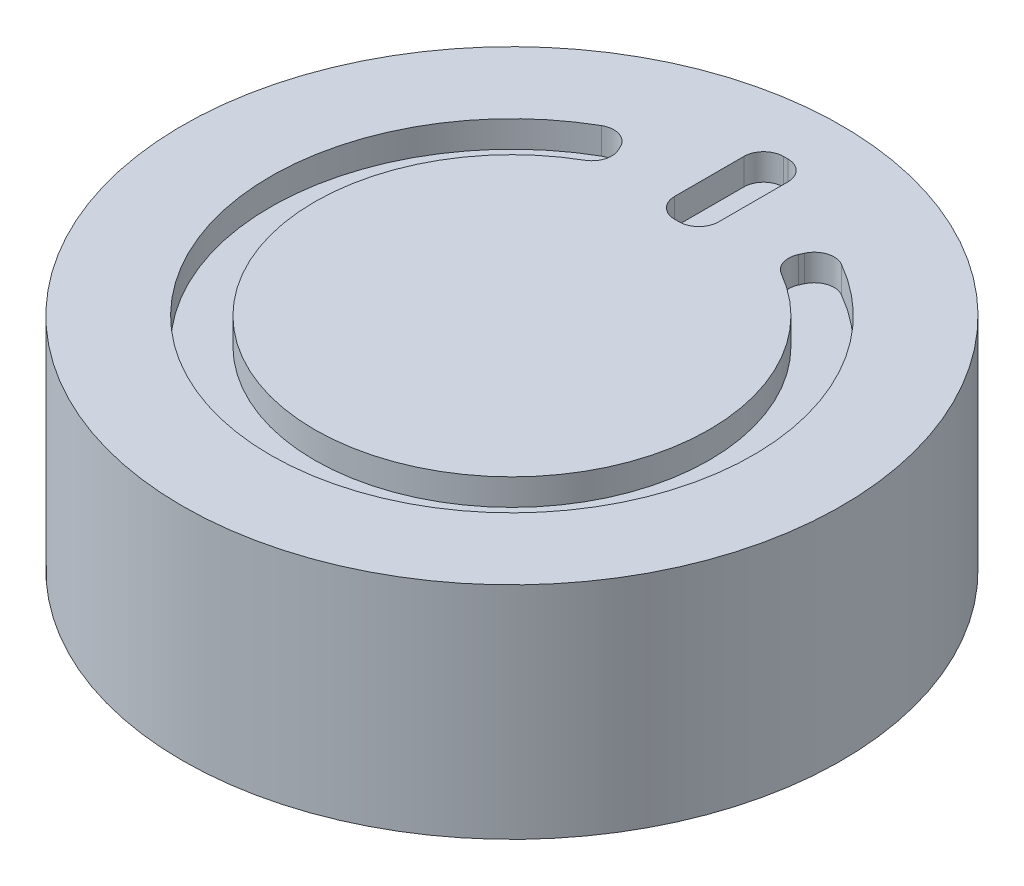
ISO-10303-21;
HEADER;
FILE_DESCRIPTION(('STEP AP214'),'2;1');
FILE_NAME('part.step','',(''),(''),'','','');
FILE_SCHEMA(('AUTOMOTIVE_DESIGN { 1 0 10303 214 1 1 1 1 }'));
ENDSEC;
DATA;
#1=APPLICATION_CONTEXT('core data for automotive mechanical design processes');
#2=APPLICATION_PROTOCOL_DEFINITION('international standard','automotive_design',2000,#1);
#3=PRODUCT_CONTEXT('',#1,'mechanical');
#4=PRODUCT('Part','Part','',(#3));
#5=PRODUCT_RELATED_PRODUCT_CATEGORY('part','',(#4));
#6=PRODUCT_DEFINITION_FORMATION('','',#4);
#7=PRODUCT_DEFINITION_CONTEXT('part definition',#1,'design');
#8=PRODUCT_DEFINITION('design','',#6,#7);
#9=PRODUCT_DEFINITION_SHAPE('','',#8);
#10=(LENGTH_UNIT() NAMED_UNIT(*) SI_UNIT(.MILLI.,.METRE.));
#11=(NAMED_UNIT(*) PLANE_ANGLE_UNIT() SI_UNIT($,.RADIAN.));
#12=(NAMED_UNIT(*) SI_UNIT($,.STERADIAN.) SOLID_ANGLE_UNIT());
#13=UNCERTAINTY_MEASURE_WITH_UNIT(LENGTH_MEASURE(1.E-05),#10,'distance_accuracy_value','');
#14=(GEOMETRIC_REPRESENTATION_CONTEXT(3) GLOBAL_UNCERTAINTY_ASSIGNED_CONTEXT((#13)) GLOBAL_UNIT_ASSIGNED_CONTEXT((#10,
#11,#12)) REPRESENTATION_CONTEXT('',''));
#15=CARTESIAN_POINT('',(0.,0.,0.));
#16=DIRECTION('',(0.,0.,1.));
#17=DIRECTION('',(1.,0.,0.));
#18=AXIS2_PLACEMENT_3D('',#15,#16,#17);
#19=CARTESIAN_POINT('',(0.,10.,0.));
#20=DIRECTION('',(0.,1.,0.));
#21=DIRECTION('',(0.,0.,1.));
#22=AXIS2_PLACEMENT_3D('',#19,#20,#21);
#23=PLANE('',#22);
#24=CARTESIAN_POINT('',(-4.9130049859856,10.,-8.5372643163768));
#25=DIRECTION('',(0.,1.,0.));
#26=DIRECTION('',(0.,0.,1.));
#27=AXIS2_PLACEMENT_3D('',#24,#25,#26);
#28=CIRCLE('',#27,0.9);
#29=CARTESIAN_POINT('',(-4.46410097711382,10.,-7.75720970878907));
#30=VERTEX_POINT('',#29);
#31=CARTESIAN_POINT('',(-4.09519676680745,10.,-8.91301651749446));
#32=VERTEX_POINT('',#31);
#33=EDGE_CURVE('E103',#30,#32,#28,.T.);
#34=ORIENTED_EDGE('',*,*,#33,.F.);
#35=CARTESIAN_POINT('',(0.,10.,0.));
#36=DIRECTION('',(0.,1.,0.));
#37=DIRECTION('',(0.,0.,1.));
#38=AXIS2_PLACEMENT_3D('',#35,#36,#37);
#39=CIRCLE('',#38,8.95);
#40=CARTESIAN_POINT('',(4.46410097711382,10.,-7.75720970878908));
#41=VERTEX_POINT('',#40);
#42=EDGE_CURVE('E210',#30,#41,#39,.T.);
#43=ORIENTED_EDGE('',*,*,#42,.T.);
#44=CARTESIAN_POINT('',(4.9130049859856,10.,-8.5372643163768));
#45=DIRECTION('',(0.,-1.,0.));
#46=DIRECTION('',(0.,0.,-1.));
#47=AXIS2_PLACEMENT_3D('',#44,#45,#46);
#48=CIRCLE('',#47,0.9);
#49=CARTESIAN_POINT('',(4.09519676680752,10.,-8.91301651749447));
#50=VERTEX_POINT('',#49);
#51=EDGE_CURVE('E217',#41,#50,#48,.T.);
#52=ORIENTED_EDGE('',*,*,#51,.T.);
#53=DIRECTION('',(0.417502445686298,0.,-0.908675799086759));
#54=VECTOR('',#53,1.);
#55=CARTESIAN_POINT('',(4.09519676680752,10.,-8.91301651749447));
#56=LINE('',#55,#54);
#57=CARTESIAN_POINT('',(4.17904098587748,10.,-9.0954997904654));
#58=VERTEX_POINT('',#57);
#59=EDGE_CURVE('E552',#50,#58,#56,.T.);
#60=ORIENTED_EDGE('',*,*,#59,.T.);
#61=CARTESIAN_POINT('',(4.99684920505556,10.,-8.71974758934773));
#62=DIRECTION('',(0.,1.,0.));
#63=DIRECTION('',(0.,0.,1.));
#64=AXIS2_PLACEMENT_3D('',#61,#62,#63);
#65=CIRCLE('',#64,0.899999999999999);
#66=CARTESIAN_POINT('',(5.44432823834412,10.,-9.50062050779678));
#67=VERTEX_POINT('',#66);
#68=EDGE_CURVE('E556',#67,#58,#65,.T.);
#69=ORIENTED_EDGE('',*,*,#68,.F.);
#70=CARTESIAN_POINT('',(0.,10.,0.));
#71=DIRECTION('',(0.,1.,0.));
#72=DIRECTION('',(0.,0.,1.));
#73=AXIS2_PLACEMENT_3D('',#70,#71,#72);
#74=CIRCLE('',#73,10.95);
#75=CARTESIAN_POINT('',(-5.44432823834412,10.,-9.50062050779678));
#76=VERTEX_POINT('',#75);
#77=EDGE_CURVE('E560',#76,#67,#74,.T.);
#78=ORIENTED_EDGE('',*,*,#77,.F.);
#79=CARTESIAN_POINT('',(-4.99684920505556,10.,-8.71974758934773));
#80=DIRECTION('',(0.,-1.,0.));
#81=DIRECTION('',(0.,0.,-1.));
#82=AXIS2_PLACEMENT_3D('',#79,#80,#81);
#83=CIRCLE('',#82,0.899999999999999);
#84=CARTESIAN_POINT('',(-4.17904098587748,10.,-9.09549979046539));
#85=VERTEX_POINT('',#84);
#86=EDGE_CURVE('E230',#76,#85,#83,.T.);
#87=ORIENTED_EDGE('',*,*,#86,.T.);
#88=DIRECTION('',(-0.417502445686294,0.,-0.908675799086761));
#89=VECTOR('',#88,1.);
#90=CARTESIAN_POINT('',(-4.09519676680751,10.,-8.91301651749446));
#91=LINE('',#90,#89);
#92=EDGE_CURVE('E223',#32,#85,#91,.T.);
#93=ORIENTED_EDGE('',*,*,#92,.F.);
#94=EDGE_LOOP('',(#34,#43,#52,#60,#69,#78,#87,#93));
#95=FACE_BOUND('',#94,.T.);
#96=CARTESIAN_POINT('',(0.,10.,0.));
#97=DIRECTION('',(0.,1.,0.));
#98=DIRECTION('',(0.,0.,1.));
#99=AXIS2_PLACEMENT_3D('',#96,#97,#98);
#100=CIRCLE('',#99,14.95);
#101=CARTESIAN_POINT('',(0.,10.,14.95));
#102=VERTEX_POINT('',#101);
#103=EDGE_CURVE('E12',#102,#102,#100,.T.);
#104=ORIENTED_EDGE('',*,*,#103,.T.);
#105=EDGE_LOOP('',(#104));
#106=FACE_BOUND('',#105,.T.);
#107=DIRECTION('',(1.,0.,0.));
#108=VECTOR('',#107,1.);
#109=CARTESIAN_POINT('',(0.,10.,-7.47958609432388));
#110=LINE('',#109,#108);
#111=CARTESIAN_POINT('',(-0.1,10.,-7.47958609432388));
#112=VERTEX_POINT('',#111);
#113=CARTESIAN_POINT('',(0.100000000000001,10.,-7.47958609432388));
#114=VERTEX_POINT('',#113);
#115=EDGE_CURVE('E228',#112,#114,#110,.T.);
#116=ORIENTED_EDGE('',*,*,#115,.F.);
#117=CARTESIAN_POINT('',(-0.1,10.,-8.37958609432388));
#118=DIRECTION('',(0.,1.,0.));
#119=DIRECTION('',(0.,0.,1.));
#120=AXIS2_PLACEMENT_3D('',#117,#118,#119);
#121=CIRCLE('',#120,0.9);
#122=CARTESIAN_POINT('',(-1.,10.,-8.37958609432388));
#123=VERTEX_POINT('',#122);
#124=EDGE_CURVE('E111',#112,#123,#121,.F.);
#125=ORIENTED_EDGE('',*,*,#124,.T.);
#126=DIRECTION('',(0.,0.,1.));
#127=VECTOR('',#126,1.);
#128=CARTESIAN_POINT('',(-1.,10.,0.));
#129=LINE('',#128,#127);
#130=CARTESIAN_POINT('',(-1.,10.,-11.5204139056761));
#131=VERTEX_POINT('',#130);
#132=EDGE_CURVE('E265',#131,#123,#129,.T.);
#133=ORIENTED_EDGE('',*,*,#132,.F.);
#134=CARTESIAN_POINT('',(-0.1,10.,-11.5204139056761));
#135=DIRECTION('',(0.,1.,0.));
#136=DIRECTION('',(0.,0.,1.));
#137=AXIS2_PLACEMENT_3D('',#134,#135,#136);
#138=CIRCLE('',#137,0.9);
#139=CARTESIAN_POINT('',(-0.1,10.,-12.4204139056761));
#140=VERTEX_POINT('',#139);
#141=EDGE_CURVE('E311',#140,#131,#138,.T.);
#142=ORIENTED_EDGE('',*,*,#141,.F.);
#143=DIRECTION('',(1.,0.,0.));
#144=VECTOR('',#143,1.);
#145=CARTESIAN_POINT('',(0.,10.,-12.4204139056761));
#146=LINE('',#145,#144);
#147=CARTESIAN_POINT('',(0.0999999999999995,10.,-12.4204139056761));
#148=VERTEX_POINT('',#147);
#149=EDGE_CURVE('E307',#140,#148,#146,.T.);
#150=ORIENTED_EDGE('',*,*,#149,.T.);
#151=CARTESIAN_POINT('',(0.0999999999999996,10.,-11.5204139056761));
#152=DIRECTION('',(0.,1.,0.));
#153=DIRECTION('',(0.,0.,1.));
#154=AXIS2_PLACEMENT_3D('',#151,#152,#153);
#155=CIRCLE('',#154,0.9);
#156=CARTESIAN_POINT('',(1.,10.,-11.5204139056761));
#157=VERTEX_POINT('',#156);
#158=EDGE_CURVE('E303',#157,#148,#155,.T.);
#159=ORIENTED_EDGE('',*,*,#158,.F.);
#160=DIRECTION('',(0.,0.,1.));
#161=VECTOR('',#160,1.);
#162=CARTESIAN_POINT('',(1.,10.,0.));
#163=LINE('',#162,#161);
#164=CARTESIAN_POINT('',(1.,10.,-8.37958609432388));
#165=VERTEX_POINT('',#164);
#166=EDGE_CURVE('E299',#157,#165,#163,.T.);
#167=ORIENTED_EDGE('',*,*,#166,.T.);
#168=CARTESIAN_POINT('',(0.1,10.,-8.37958609432388));
#169=DIRECTION('',(0.,1.,0.));
#170=DIRECTION('',(0.,0.,1.));
#171=AXIS2_PLACEMENT_3D('',#168,#169,#170);
#172=CIRCLE('',#171,0.9);
#173=EDGE_CURVE('E295',#114,#165,#172,.T.);
#174=ORIENTED_EDGE('',*,*,#173,.F.);
#175=EDGE_LOOP('',(#116,#125,#133,#142,#150,#159,#167,#174));
#176=FACE_BOUND('',#175,.T.);
#177=ADVANCED_FACE('F87',(#95,#106,#176),#23,.T.);
#178=CARTESIAN_POINT('',(0.,10.,0.));
#179=DIRECTION('',(0.,-1.,0.));
#180=DIRECTION('',(0.,0.,-1.));
#181=AXIS2_PLACEMENT_3D('',#178,#179,#180);
#182=CYLINDRICAL_SURFACE('',#181,14.95);
#183=ORIENTED_EDGE('',*,*,#103,.F.);
#184=EDGE_LOOP('',(#183));
#185=FACE_BOUND('',#184,.T.);
#186=CARTESIAN_POINT('',(0.,0.,0.));
#187=DIRECTION('',(0.,1.,0.));
#188=DIRECTION('',(0.,0.,1.));
#189=AXIS2_PLACEMENT_3D('',#186,#187,#188);
#190=CIRCLE('',#189,14.95);
#191=CARTESIAN_POINT('',(0.,0.,14.95));
#192=VERTEX_POINT('',#191);
#193=EDGE_CURVE('E91',#192,#192,#190,.T.);
#194=ORIENTED_EDGE('',*,*,#193,.T.);
#195=EDGE_LOOP('',(#194));
#196=FACE_BOUND('',#195,.T.);
#197=ADVANCED_FACE('F89',(#185,#196),#182,.T.);
#198=CARTESIAN_POINT('',(0.,0.,0.));
#199=DIRECTION('',(0.,1.,0.));
#200=DIRECTION('',(0.,0.,1.));
#201=AXIS2_PLACEMENT_3D('',#198,#199,#200);
#202=PLANE('',#201);
#203=ORIENTED_EDGE('',*,*,#193,.F.);
#204=EDGE_LOOP('',(#203));
#205=FACE_BOUND('',#204,.T.);
#206=ADVANCED_FACE('F389',(#205),#202,.F.);
#207=CARTESIAN_POINT('',(-0.1,8.8,-8.37958609432388));
#208=DIRECTION('',(0.,1.,0.));
#209=DIRECTION('',(0.,0.,1.));
#210=AXIS2_PLACEMENT_3D('',#207,#208,#209);
#211=CYLINDRICAL_SURFACE('',#210,0.9);
#212=ORIENTED_EDGE('',*,*,#124,.F.);
#213=DIRECTION('',(0.,1.,0.));
#214=VECTOR('',#213,1.);
#215=CARTESIAN_POINT('',(-0.1,8.8,-7.47958609432388));
#216=LINE('',#215,#214);
#217=CARTESIAN_POINT('',(-0.1,8.8,-7.47958609432388));
#218=VERTEX_POINT('',#217);
#219=EDGE_CURVE('E290',#218,#112,#216,.T.);
#220=ORIENTED_EDGE('',*,*,#219,.F.);
#221=CARTESIAN_POINT('',(-0.1,8.8,-8.37958609432388));
#222=DIRECTION('',(0.,1.,0.));
#223=DIRECTION('',(0.,0.,1.));
#224=AXIS2_PLACEMENT_3D('',#221,#222,#223);
#225=CIRCLE('',#224,0.9);
#226=CARTESIAN_POINT('',(-1.,8.8,-8.37958609432388));
#227=VERTEX_POINT('',#226);
#228=EDGE_CURVE('E261',#218,#227,#225,.F.);
#229=ORIENTED_EDGE('',*,*,#228,.T.);
#230=DIRECTION('',(0.,1.,0.));
#231=VECTOR('',#230,1.);
#232=CARTESIAN_POINT('',(-1.,8.8,-8.37958609432388));
#233=LINE('',#232,#231);
#234=EDGE_CURVE('E318',#227,#123,#233,.T.);
#235=ORIENTED_EDGE('',*,*,#234,.T.);
#236=EDGE_LOOP('',(#212,#220,#229,#235));
#237=FACE_BOUND('',#236,.T.);
#238=ADVANCED_FACE('F359',(#237),#211,.F.);
#239=CARTESIAN_POINT('',(-1.,8.8,0.));
#240=DIRECTION('',(-1.,0.,0.));
#241=DIRECTION('',(0.,0.,1.));
#242=AXIS2_PLACEMENT_3D('',#239,#240,#241);
#243=PLANE('',#242);
#244=ORIENTED_EDGE('',*,*,#132,.T.);
#245=ORIENTED_EDGE('',*,*,#234,.F.);
#246=DIRECTION('',(0.,0.,1.));
#247=VECTOR('',#246,1.);
#248=CARTESIAN_POINT('',(-1.,8.8,0.));
#249=LINE('',#248,#247);
#250=CARTESIAN_POINT('',(-1.,8.8,-11.5204139056761));
#251=VERTEX_POINT('',#250);
#252=EDGE_CURVE('E287',#251,#227,#249,.T.);
#253=ORIENTED_EDGE('',*,*,#252,.F.);
#254=DIRECTION('',(0.,1.,0.));
#255=VECTOR('',#254,1.);
#256=CARTESIAN_POINT('',(-1.,8.8,-11.5204139056761));
#257=LINE('',#256,#255);
#258=EDGE_CURVE('E321',#251,#131,#257,.T.);
#259=ORIENTED_EDGE('',*,*,#258,.T.);
#260=EDGE_LOOP('',(#244,#245,#253,#259));
#261=FACE_BOUND('',#260,.T.);
#262=ADVANCED_FACE('F361',(#261),#243,.F.);
#263=CARTESIAN_POINT('',(-0.1,8.8,-11.5204139056761));
#264=DIRECTION('',(0.,1.,0.));
#265=DIRECTION('',(0.,0.,1.));
#266=AXIS2_PLACEMENT_3D('',#263,#264,#265);
#267=CYLINDRICAL_SURFACE('',#266,0.9);
#268=ORIENTED_EDGE('',*,*,#141,.T.);
#269=ORIENTED_EDGE('',*,*,#258,.F.);
#270=CARTESIAN_POINT('',(-0.1,8.8,-11.5204139056761));
#271=DIRECTION('',(0.,1.,0.));
#272=DIRECTION('',(0.,0.,1.));
#273=AXIS2_PLACEMENT_3D('',#270,#271,#272);
#274=CIRCLE('',#273,0.9);
#275=CARTESIAN_POINT('',(-0.1,8.8,-12.4204139056761));
#276=VERTEX_POINT('',#275);
#277=EDGE_CURVE('E283',#276,#251,#274,.T.);
#278=ORIENTED_EDGE('',*,*,#277,.F.);
#279=DIRECTION('',(0.,1.,0.));
#280=VECTOR('',#279,1.);
#281=CARTESIAN_POINT('',(-0.1,8.8,-12.4204139056761));
#282=LINE('',#281,#280);
#283=EDGE_CURVE('E324',#276,#140,#282,.T.);
#284=ORIENTED_EDGE('',*,*,#283,.T.);
#285=EDGE_LOOP('',(#268,#269,#278,#284));
#286=FACE_BOUND('',#285,.T.);
#287=ADVANCED_FACE('F365',(#286),#267,.F.);
#288=CARTESIAN_POINT('',(0.,8.8,-12.4204139056761));
#289=DIRECTION('',(0.,0.,1.));
#290=DIRECTION('',(1.,0.,0.));
#291=AXIS2_PLACEMENT_3D('',#288,#289,#290);
#292=PLANE('',#291);
#293=ORIENTED_EDGE('',*,*,#149,.F.);
#294=ORIENTED_EDGE('',*,*,#283,.F.);
#295=DIRECTION('',(1.,0.,0.));
#296=VECTOR('',#295,1.);
#297=CARTESIAN_POINT('',(0.,8.8,-12.4204139056761));
#298=LINE('',#297,#296);
#299=CARTESIAN_POINT('',(0.0999999999999995,8.8,-12.4204139056761));
#300=VERTEX_POINT('',#299);
#301=EDGE_CURVE('E280',#276,#300,#298,.T.);
#302=ORIENTED_EDGE('',*,*,#301,.T.);
#303=DIRECTION('',(0.,1.,0.));
#304=VECTOR('',#303,1.);
#305=CARTESIAN_POINT('',(0.0999999999999995,8.8,-12.4204139056761));
#306=LINE('',#305,#304);
#307=EDGE_CURVE('E327',#300,#148,#306,.T.);
#308=ORIENTED_EDGE('',*,*,#307,.T.);
#309=EDGE_LOOP('',(#293,#294,#302,#308));
#310=FACE_BOUND('',#309,.T.);
#311=ADVANCED_FACE('F369',(#310),#292,.T.);
#312=CARTESIAN_POINT('',(0.0999999999999996,8.8,-11.5204139056761));
#313=DIRECTION('',(0.,1.,0.));
#314=DIRECTION('',(0.,0.,1.));
#315=AXIS2_PLACEMENT_3D('',#312,#313,#314);
#316=CYLINDRICAL_SURFACE('',#315,0.9);
#317=ORIENTED_EDGE('',*,*,#158,.T.);
#318=ORIENTED_EDGE('',*,*,#307,.F.);
#319=CARTESIAN_POINT('',(0.0999999999999996,8.8,-11.5204139056761));
#320=DIRECTION('',(0.,1.,0.));
#321=DIRECTION('',(0.,0.,1.));
#322=AXIS2_PLACEMENT_3D('',#319,#320,#321);
#323=CIRCLE('',#322,0.9);
#324=CARTESIAN_POINT('',(1.,8.8,-11.5204139056761));
#325=VERTEX_POINT('',#324);
#326=EDGE_CURVE('E276',#325,#300,#323,.T.);
#327=ORIENTED_EDGE('',*,*,#326,.F.);
#328=DIRECTION('',(0.,1.,0.));
#329=VECTOR('',#328,1.);
#330=CARTESIAN_POINT('',(1.,8.8,-11.5204139056761));
#331=LINE('',#330,#329);
#332=EDGE_CURVE('E330',#325,#157,#331,.T.);
#333=ORIENTED_EDGE('',*,*,#332,.T.);
#334=EDGE_LOOP('',(#317,#318,#327,#333));
#335=FACE_BOUND('',#334,.T.);
#336=ADVANCED_FACE('F373',(#335),#316,.F.);
#337=CARTESIAN_POINT('',(1.,8.8,0.));
#338=DIRECTION('',(-1.,0.,0.));
#339=DIRECTION('',(0.,0.,1.));
#340=AXIS2_PLACEMENT_3D('',#337,#338,#339);
#341=PLANE('',#340);
#342=ORIENTED_EDGE('',*,*,#166,.F.);
#343=ORIENTED_EDGE('',*,*,#332,.F.);
#344=DIRECTION('',(0.,0.,1.));
#345=VECTOR('',#344,1.);
#346=CARTESIAN_POINT('',(1.,8.8,0.));
#347=LINE('',#346,#345);
#348=CARTESIAN_POINT('',(1.,8.8,-8.37958609432388));
#349=VERTEX_POINT('',#348);
#350=EDGE_CURVE('E273',#325,#349,#347,.T.);
#351=ORIENTED_EDGE('',*,*,#350,.T.);
#352=DIRECTION('',(0.,1.,0.));
#353=VECTOR('',#352,1.);
#354=CARTESIAN_POINT('',(1.,8.8,-8.37958609432388));
#355=LINE('',#354,#353);
#356=EDGE_CURVE('E333',#349,#165,#355,.T.);
#357=ORIENTED_EDGE('',*,*,#356,.T.);
#358=EDGE_LOOP('',(#342,#343,#351,#357));
#359=FACE_BOUND('',#358,.T.);
#360=ADVANCED_FACE('F375',(#359),#341,.T.);
#361=CARTESIAN_POINT('',(0.1,8.8,-8.37958609432388));
#362=DIRECTION('',(0.,1.,0.));
#363=DIRECTION('',(0.,0.,1.));
#364=AXIS2_PLACEMENT_3D('',#361,#362,#363);
#365=CYLINDRICAL_SURFACE('',#364,0.9);
#366=ORIENTED_EDGE('',*,*,#173,.T.);
#367=ORIENTED_EDGE('',*,*,#356,.F.);
#368=CARTESIAN_POINT('',(0.1,8.8,-8.37958609432388));
#369=DIRECTION('',(0.,1.,0.));
#370=DIRECTION('',(0.,0.,1.));
#371=AXIS2_PLACEMENT_3D('',#368,#369,#370);
#372=CIRCLE('',#371,0.9);
#373=CARTESIAN_POINT('',(0.100000000000001,8.8,-7.47958609432388));
#374=VERTEX_POINT('',#373);
#375=EDGE_CURVE('E269',#374,#349,#372,.T.);
#376=ORIENTED_EDGE('',*,*,#375,.F.);
#377=DIRECTION('',(0.,1.,0.));
#378=VECTOR('',#377,1.);
#379=CARTESIAN_POINT('',(0.100000000000001,8.8,-7.47958609432388));
#380=LINE('',#379,#378);
#381=EDGE_CURVE('E336',#374,#114,#380,.T.);
#382=ORIENTED_EDGE('',*,*,#381,.T.);
#383=EDGE_LOOP('',(#366,#367,#376,#382));
#384=FACE_BOUND('',#383,.T.);
#385=ADVANCED_FACE('F352',(#384),#365,.F.);
#386=CARTESIAN_POINT('',(0.,8.8,-7.47958609432388));
#387=DIRECTION('',(0.,0.,1.));
#388=DIRECTION('',(1.,0.,0.));
#389=AXIS2_PLACEMENT_3D('',#386,#387,#388);
#390=PLANE('',#389);
#391=ORIENTED_EDGE('',*,*,#115,.T.);
#392=ORIENTED_EDGE('',*,*,#381,.F.);
#393=DIRECTION('',(1.,0.,0.));
#394=VECTOR('',#393,1.);
#395=CARTESIAN_POINT('',(0.,8.8,-7.47958609432388));
#396=LINE('',#395,#394);
#397=EDGE_CURVE('E264',#218,#374,#396,.T.);
#398=ORIENTED_EDGE('',*,*,#397,.F.);
#399=ORIENTED_EDGE('',*,*,#219,.T.);
#400=EDGE_LOOP('',(#391,#392,#398,#399));
#401=FACE_BOUND('',#400,.T.);
#402=ADVANCED_FACE('F343',(#401),#390,.F.);
#403=CARTESIAN_POINT('',(0.,8.8,0.));
#404=DIRECTION('',(0.,1.,0.));
#405=DIRECTION('',(0.,0.,1.));
#406=AXIS2_PLACEMENT_3D('',#403,#404,#405);
#407=PLANE('',#406);
#408=ORIENTED_EDGE('',*,*,#228,.F.);
#409=ORIENTED_EDGE('',*,*,#397,.T.);
#410=ORIENTED_EDGE('',*,*,#375,.T.);
#411=ORIENTED_EDGE('',*,*,#350,.F.);
#412=ORIENTED_EDGE('',*,*,#326,.T.);
#413=ORIENTED_EDGE('',*,*,#301,.F.);
#414=ORIENTED_EDGE('',*,*,#277,.T.);
#415=ORIENTED_EDGE('',*,*,#252,.T.);
#416=EDGE_LOOP('',(#408,#409,#410,#411,#412,#413,#414,#415));
#417=FACE_BOUND('',#416,.T.);
#418=ADVANCED_FACE('F356',(#417),#407,.T.);
#419=CARTESIAN_POINT('',(-4.9130049859856,8.8,-8.5372643163768));
#420=DIRECTION('',(0.,1.,0.));
#421=DIRECTION('',(0.,0.,1.));
#422=AXIS2_PLACEMENT_3D('',#419,#420,#421);
#423=CYLINDRICAL_SURFACE('',#422,0.9);
#424=ORIENTED_EDGE('',*,*,#33,.T.);
#425=DIRECTION('',(0.,1.,0.));
#426=VECTOR('',#425,1.);
#427=CARTESIAN_POINT('',(-4.09519676680751,8.8,-8.91301651749446));
#428=LINE('',#427,#426);
#429=CARTESIAN_POINT('',(-4.09519676680751,8.8,-8.91301651749446));
#430=VERTEX_POINT('',#429);
#431=EDGE_CURVE('E238',#430,#32,#428,.T.);
#432=ORIENTED_EDGE('',*,*,#431,.F.);
#433=CARTESIAN_POINT('',(-4.9130049859856,8.8,-8.5372643163768));
#434=DIRECTION('',(0.,1.,0.));
#435=DIRECTION('',(0.,0.,1.));
#436=AXIS2_PLACEMENT_3D('',#433,#434,#435);
#437=CIRCLE('',#436,0.9);
#438=CARTESIAN_POINT('',(-4.46410097711382,8.8,-7.75720970878907));
#439=VERTEX_POINT('',#438);
#440=EDGE_CURVE('E203',#439,#430,#437,.T.);
#441=ORIENTED_EDGE('',*,*,#440,.F.);
#442=DIRECTION('',(0.,1.,0.));
#443=VECTOR('',#442,1.);
#444=CARTESIAN_POINT('',(-4.46410097711382,8.8,-7.75720970878907));
#445=LINE('',#444,#443);
#446=EDGE_CURVE('E199',#439,#30,#445,.T.);
#447=ORIENTED_EDGE('',*,*,#446,.T.);
#448=EDGE_LOOP('',(#424,#432,#441,#447));
#449=FACE_BOUND('',#448,.T.);
#450=ADVANCED_FACE('F201',(#449),#423,.F.);
#451=CARTESIAN_POINT('',(0.,8.8,0.));
#452=DIRECTION('',(0.,1.,0.));
#453=DIRECTION('',(0.,0.,1.));
#454=AXIS2_PLACEMENT_3D('',#451,#452,#453);
#455=CYLINDRICAL_SURFACE('',#454,8.95);
#456=ORIENTED_EDGE('',*,*,#42,.F.);
#457=ORIENTED_EDGE('',*,*,#446,.F.);
#458=CARTESIAN_POINT('',(0.,8.8,0.));
#459=DIRECTION('',(0.,1.,0.));
#460=DIRECTION('',(0.,0.,1.));
#461=AXIS2_PLACEMENT_3D('',#458,#459,#460);
#462=CIRCLE('',#461,8.95);
#463=CARTESIAN_POINT('',(4.46410097711382,8.8,-7.75720970878908));
#464=VERTEX_POINT('',#463);
#465=EDGE_CURVE('E234',#439,#464,#462,.T.);
#466=ORIENTED_EDGE('',*,*,#465,.T.);
#467=DIRECTION('',(0.,1.,0.));
#468=VECTOR('',#467,1.);
#469=CARTESIAN_POINT('',(4.46410097711382,8.8,-7.75720970878908));
#470=LINE('',#469,#468);
#471=EDGE_CURVE('E207',#464,#41,#470,.T.);
#472=ORIENTED_EDGE('',*,*,#471,.T.);
#473=EDGE_LOOP('',(#456,#457,#466,#472));
#474=FACE_BOUND('',#473,.T.);
#475=ADVANCED_FACE('F211',(#474),#455,.T.);
#476=CARTESIAN_POINT('',(4.9130049859856,8.8,-8.5372643163768));
#477=DIRECTION('',(0.,1.,0.));
#478=DIRECTION('',(0.,0.,1.));
#479=AXIS2_PLACEMENT_3D('',#476,#477,#478);
#480=CYLINDRICAL_SURFACE('',#479,0.9);
#481=ORIENTED_EDGE('',*,*,#51,.F.);
#482=ORIENTED_EDGE('',*,*,#471,.F.);
#483=CARTESIAN_POINT('',(4.9130049859856,8.8,-8.5372643163768));
#484=DIRECTION('',(0.,-1.,0.));
#485=DIRECTION('',(0.,0.,-1.));
#486=AXIS2_PLACEMENT_3D('',#483,#484,#485);
#487=CIRCLE('',#486,0.9);
#488=CARTESIAN_POINT('',(4.09519676680752,8.8,-8.91301651749447));
#489=VERTEX_POINT('',#488);
#490=EDGE_CURVE('E237',#464,#489,#487,.T.);
#491=ORIENTED_EDGE('',*,*,#490,.T.);
#492=DIRECTION('',(0.,1.,0.));
#493=VECTOR('',#492,1.);
#494=CARTESIAN_POINT('',(4.09519676680752,8.8,-8.91301651749447));
#495=LINE('',#494,#493);
#496=EDGE_CURVE('E543',#489,#50,#495,.T.);
#497=ORIENTED_EDGE('',*,*,#496,.T.);
#498=EDGE_LOOP('',(#481,#482,#491,#497));
#499=FACE_BOUND('',#498,.T.);
#500=ADVANCED_FACE('F465',(#499),#480,.F.);
#501=CARTESIAN_POINT('',(4.09519676680752,8.8,-8.91301651749447));
#502=DIRECTION('',(0.908675799086759,0.,0.417502445686298));
#503=DIRECTION('',(0.417502445686298,0.,-0.908675799086759));
#504=AXIS2_PLACEMENT_3D('',#501,#502,#503);
#505=PLANE('',#504);
#506=ORIENTED_EDGE('',*,*,#59,.F.);
#507=ORIENTED_EDGE('',*,*,#496,.F.);
#508=DIRECTION('',(0.417502445686298,0.,-0.908675799086759));
#509=VECTOR('',#508,1.);
#510=CARTESIAN_POINT('',(4.09519676680752,8.8,-8.91301651749447));
#511=LINE('',#510,#509);
#512=CARTESIAN_POINT('',(4.17904098587748,8.8,-9.0954997904654));
#513=VERTEX_POINT('',#512);
#514=EDGE_CURVE('E241',#489,#513,#511,.T.);
#515=ORIENTED_EDGE('',*,*,#514,.T.);
#516=DIRECTION('',(0.,1.,0.));
#517=VECTOR('',#516,1.);
#518=CARTESIAN_POINT('',(4.17904098587748,8.8,-9.0954997904654));
#519=LINE('',#518,#517);
#520=EDGE_CURVE('E546',#513,#58,#519,.T.);
#521=ORIENTED_EDGE('',*,*,#520,.T.);
#522=EDGE_LOOP('',(#506,#507,#515,#521));
#523=FACE_BOUND('',#522,.T.);
#524=ADVANCED_FACE('F474',(#523),#505,.T.);
#525=CARTESIAN_POINT('',(4.99684920505556,8.8,-8.71974758934773));
#526=DIRECTION('',(0.,1.,0.));
#527=DIRECTION('',(0.,0.,1.));
#528=AXIS2_PLACEMENT_3D('',#525,#526,#527);
#529=CYLINDRICAL_SURFACE('',#528,0.899999999999999);
#530=ORIENTED_EDGE('',*,*,#68,.T.);
#531=ORIENTED_EDGE('',*,*,#520,.F.);
#532=CARTESIAN_POINT('',(4.99684920505556,8.8,-8.71974758934773));
#533=DIRECTION('',(0.,1.,0.));
#534=DIRECTION('',(0.,0.,1.));
#535=AXIS2_PLACEMENT_3D('',#532,#533,#534);
#536=CIRCLE('',#535,0.899999999999999);
#537=CARTESIAN_POINT('',(5.44432823834412,8.8,-9.50062050779678));
#538=VERTEX_POINT('',#537);
#539=EDGE_CURVE('E244',#538,#513,#536,.T.);
#540=ORIENTED_EDGE('',*,*,#539,.F.);
#541=DIRECTION('',(0.,1.,0.));
#542=VECTOR('',#541,1.);
#543=CARTESIAN_POINT('',(5.44432823834412,8.8,-9.50062050779678));
#544=LINE('',#543,#542);
#545=EDGE_CURVE('E577',#538,#67,#544,.T.);
#546=ORIENTED_EDGE('',*,*,#545,.T.);
#547=EDGE_LOOP('',(#530,#531,#540,#546));
#548=FACE_BOUND('',#547,.T.);
#549=ADVANCED_FACE('F484',(#548),#529,.F.);
#550=CARTESIAN_POINT('',(0.,8.8,0.));
#551=DIRECTION('',(0.,1.,0.));
#552=DIRECTION('',(0.,0.,1.));
#553=AXIS2_PLACEMENT_3D('',#550,#551,#552);
#554=CYLINDRICAL_SURFACE('',#553,10.95);
#555=ORIENTED_EDGE('',*,*,#77,.T.);
#556=ORIENTED_EDGE('',*,*,#545,.F.);
#557=CARTESIAN_POINT('',(0.,8.8,0.));
#558=DIRECTION('',(0.,1.,0.));
#559=DIRECTION('',(0.,0.,1.));
#560=AXIS2_PLACEMENT_3D('',#557,#558,#559);
#561=CIRCLE('',#560,10.95);
#562=CARTESIAN_POINT('',(-5.44432823834412,8.8,-9.50062050779678));
#563=VERTEX_POINT('',#562);
#564=EDGE_CURVE('E248',#563,#538,#561,.T.);
#565=ORIENTED_EDGE('',*,*,#564,.F.);
#566=DIRECTION('',(0.,1.,0.));
#567=VECTOR('',#566,1.);
#568=CARTESIAN_POINT('',(-5.44432823834412,8.8,-9.50062050779678));
#569=LINE('',#568,#567);
#570=EDGE_CURVE('E567',#563,#76,#569,.T.);
#571=ORIENTED_EDGE('',*,*,#570,.T.);
#572=EDGE_LOOP('',(#555,#556,#565,#571));
#573=FACE_BOUND('',#572,.T.);
#574=ADVANCED_FACE('F494',(#573),#554,.F.);
#575=CARTESIAN_POINT('',(-4.99684920505556,8.8,-8.71974758934773));
#576=DIRECTION('',(0.,1.,0.));
#577=DIRECTION('',(0.,0.,1.));
#578=AXIS2_PLACEMENT_3D('',#575,#576,#577);
#579=CYLINDRICAL_SURFACE('',#578,0.899999999999999);
#580=ORIENTED_EDGE('',*,*,#86,.F.);
#581=ORIENTED_EDGE('',*,*,#570,.F.);
#582=CARTESIAN_POINT('',(-4.99684920505556,8.8,-8.71974758934773));
#583=DIRECTION('',(0.,-1.,0.));
#584=DIRECTION('',(0.,0.,-1.));
#585=AXIS2_PLACEMENT_3D('',#582,#583,#584);
#586=CIRCLE('',#585,0.899999999999999);
#587=CARTESIAN_POINT('',(-4.17904098587748,8.8,-9.09549979046539));
#588=VERTEX_POINT('',#587);
#589=EDGE_CURVE('E252',#563,#588,#586,.T.);
#590=ORIENTED_EDGE('',*,*,#589,.T.);
#591=DIRECTION('',(0.,1.,0.));
#592=VECTOR('',#591,1.);
#593=CARTESIAN_POINT('',(-4.17904098587748,8.8,-9.09549979046539));
#594=LINE('',#593,#592);
#595=EDGE_CURVE('E569',#588,#85,#594,.T.);
#596=ORIENTED_EDGE('',*,*,#595,.T.);
#597=EDGE_LOOP('',(#580,#581,#590,#596));
#598=FACE_BOUND('',#597,.T.);
#599=ADVANCED_FACE('F504',(#598),#579,.F.);
#600=CARTESIAN_POINT('',(-4.09519676680751,8.8,-8.91301651749446));
#601=DIRECTION('',(0.908675799086761,0.,-0.417502445686294));
#602=DIRECTION('',(-0.417502445686294,0.,-0.908675799086761));
#603=AXIS2_PLACEMENT_3D('',#600,#601,#602);
#604=PLANE('',#603);
#605=ORIENTED_EDGE('',*,*,#92,.T.);
#606=ORIENTED_EDGE('',*,*,#595,.F.);
#607=DIRECTION('',(-0.417502445686294,0.,-0.908675799086761));
#608=VECTOR('',#607,1.);
#609=CARTESIAN_POINT('',(-4.09519676680751,8.8,-8.91301651749446));
#610=LINE('',#609,#608);
#611=EDGE_CURVE('E255',#430,#588,#610,.T.);
#612=ORIENTED_EDGE('',*,*,#611,.F.);
#613=ORIENTED_EDGE('',*,*,#431,.T.);
#614=EDGE_LOOP('',(#605,#606,#612,#613));
#615=FACE_BOUND('',#614,.T.);
#616=ADVANCED_FACE('F514',(#615),#604,.F.);
#617=CARTESIAN_POINT('',(-4.9130049859856,8.8,-8.5372643163768));
#618=DIRECTION('',(0.,1.,0.));
#619=DIRECTION('',(0.,0.,1.));
#620=AXIS2_PLACEMENT_3D('',#617,#618,#619);
#621=PLANE('',#620);
#622=ORIENTED_EDGE('',*,*,#440,.T.);
#623=ORIENTED_EDGE('',*,*,#611,.T.);
#624=ORIENTED_EDGE('',*,*,#589,.F.);
#625=ORIENTED_EDGE('',*,*,#564,.T.);
#626=ORIENTED_EDGE('',*,*,#539,.T.);
#627=ORIENTED_EDGE('',*,*,#514,.F.);
#628=ORIENTED_EDGE('',*,*,#490,.F.);
#629=ORIENTED_EDGE('',*,*,#465,.F.);
#630=EDGE_LOOP('',(#622,#623,#624,#625,#626,#627,#628,#629));
#631=FACE_BOUND('',#630,.T.);
#632=ADVANCED_FACE('F524',(#631),#621,.T.);
#633=CLOSED_SHELL('',(#177,#197,#206,#238,#262,#287,#311,#336,#360,#385,#402,#418,#450,#475,
#500,#524,#549,#574,#599,#616,#632));
#634=MANIFOLD_SOLID_BREP('B2',#633);
#635=ADVANCED_BREP_SHAPE_REPRESENTATION('',(#18,#634),#14);
#636=SHAPE_DEFINITION_REPRESENTATION(#9,#635);
ENDSEC;
END-ISO-10303-21;
